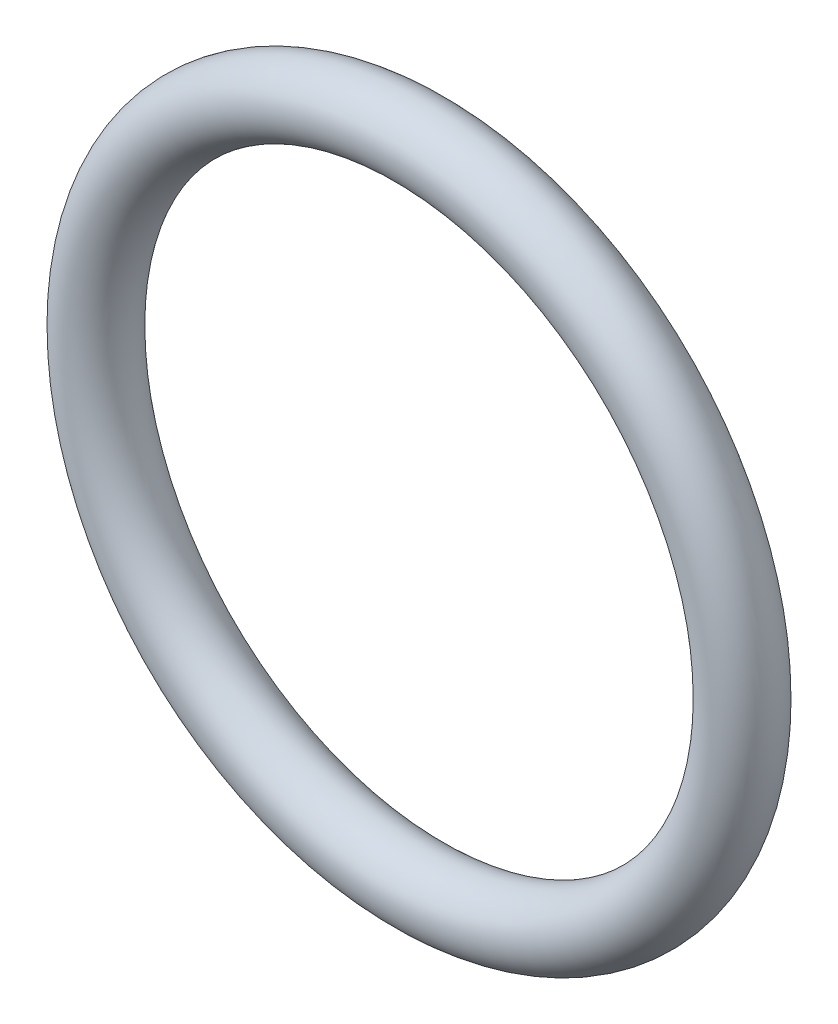
ISO-10303-21;
HEADER;
FILE_DESCRIPTION(('STEP AP214'),'2;1');
FILE_NAME('part.step','',(''),(''),'','','');
FILE_SCHEMA(('AUTOMOTIVE_DESIGN { 1 0 10303 214 1 1 1 1 }'));
ENDSEC;
DATA;
#1=APPLICATION_CONTEXT('core data for automotive mechanical design processes');
#2=APPLICATION_PROTOCOL_DEFINITION('international standard','automotive_design',2000,#1);
#3=PRODUCT_CONTEXT('',#1,'mechanical');
#4=PRODUCT('Part','Part','',(#3));
#5=PRODUCT_RELATED_PRODUCT_CATEGORY('part','',(#4));
#6=PRODUCT_DEFINITION_FORMATION('','',#4);
#7=PRODUCT_DEFINITION_CONTEXT('part definition',#1,'design');
#8=PRODUCT_DEFINITION('design','',#6,#7);
#9=PRODUCT_DEFINITION_SHAPE('','',#8);
#10=(LENGTH_UNIT() NAMED_UNIT(*) SI_UNIT(.MILLI.,.METRE.));
#11=(NAMED_UNIT(*) PLANE_ANGLE_UNIT() SI_UNIT($,.RADIAN.));
#12=(NAMED_UNIT(*) SI_UNIT($,.STERADIAN.) SOLID_ANGLE_UNIT());
#13=UNCERTAINTY_MEASURE_WITH_UNIT(LENGTH_MEASURE(1.E-05),#10,'distance_accuracy_value','');
#14=(GEOMETRIC_REPRESENTATION_CONTEXT(3) GLOBAL_UNCERTAINTY_ASSIGNED_CONTEXT((#13)) GLOBAL_UNIT_ASSIGNED_CONTEXT((#10,
#11,#12)) REPRESENTATION_CONTEXT('',''));
#15=CARTESIAN_POINT('',(0.,0.,0.));
#16=DIRECTION('',(0.,0.,1.));
#17=DIRECTION('',(1.,0.,0.));
#18=AXIS2_PLACEMENT_3D('',#15,#16,#17);
#19=CARTESIAN_POINT('',(0.,0.,0.));
#20=DIRECTION('',(0.,0.,1.));
#21=DIRECTION('',(1.,0.,0.));
#22=AXIS2_PLACEMENT_3D('',#19,#20,#21);
#23=TOROIDAL_SURFACE('',#22,6.9977,0.7493);
#24=CARTESIAN_POINT('',(7.747,0.,0.));
#25=VERTEX_POINT('',#24);
#26=VERTEX_LOOP('',#25);
#27=FACE_BOUND('',#26,.T.);
#28=ADVANCED_FACE('F30',(#27),#23,.T.);
#29=CLOSED_SHELL('',(#28));
#30=MANIFOLD_SOLID_BREP('B2',#29);
#31=ADVANCED_BREP_SHAPE_REPRESENTATION('',(#18,#30),#14);
#32=SHAPE_DEFINITION_REPRESENTATION(#9,#31);
ENDSEC;
END-ISO-10303-21;
